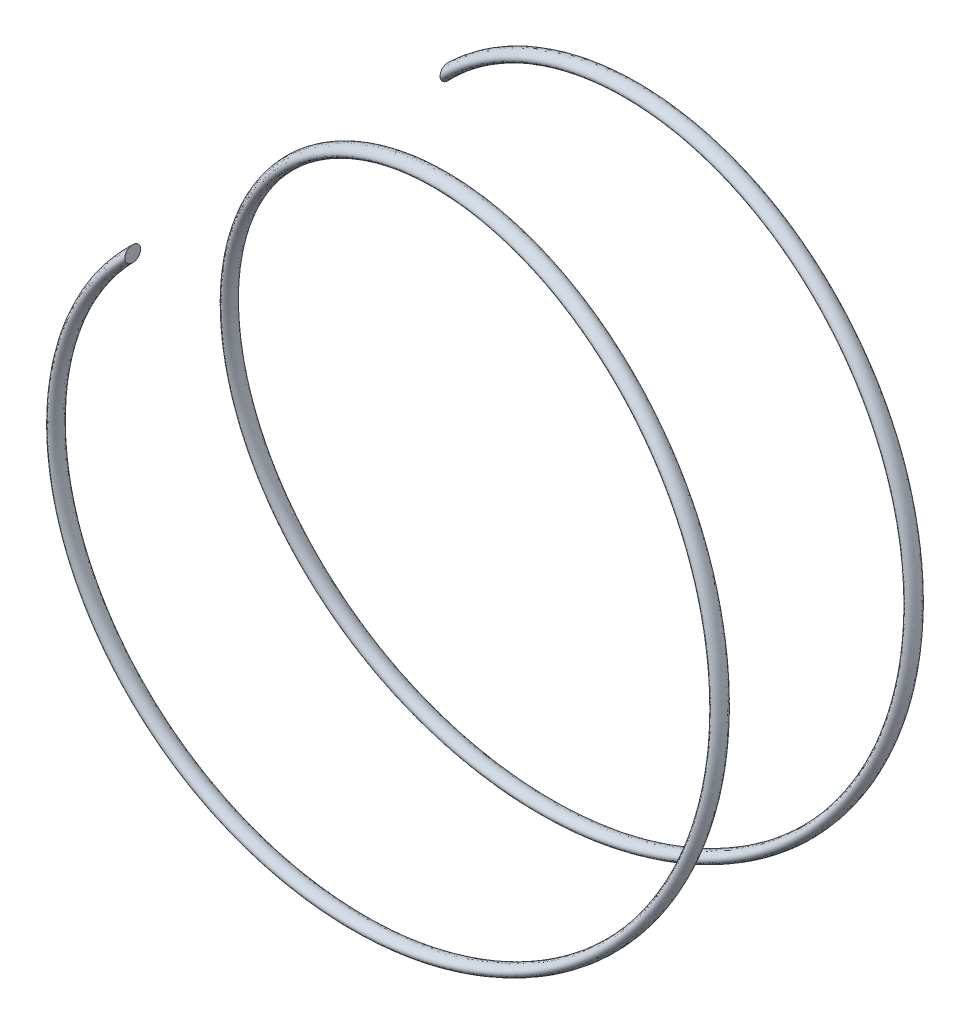
ISO-10303-21;
HEADER;
FILE_DESCRIPTION(('STEP AP214'),'2;1');
FILE_NAME('part.step','',(''),(''),'','','');
FILE_SCHEMA(('AUTOMOTIVE_DESIGN { 1 0 10303 214 1 1 1 1 }'));
ENDSEC;
DATA;
#1=APPLICATION_CONTEXT('core data for automotive mechanical design processes');
#2=APPLICATION_PROTOCOL_DEFINITION('international standard','automotive_design',2000,#1);
#3=PRODUCT_CONTEXT('',#1,'mechanical');
#4=PRODUCT('Part','Part','',(#3));
#5=PRODUCT_RELATED_PRODUCT_CATEGORY('part','',(#4));
#6=PRODUCT_DEFINITION_FORMATION('','',#4);
#7=PRODUCT_DEFINITION_CONTEXT('part definition',#1,'design');
#8=PRODUCT_DEFINITION('design','',#6,#7);
#9=PRODUCT_DEFINITION_SHAPE('','',#8);
#10=(LENGTH_UNIT() NAMED_UNIT(*) SI_UNIT(.MILLI.,.METRE.));
#11=(NAMED_UNIT(*) PLANE_ANGLE_UNIT() SI_UNIT($,.RADIAN.));
#12=(NAMED_UNIT(*) SI_UNIT($,.STERADIAN.) SOLID_ANGLE_UNIT());
#13=UNCERTAINTY_MEASURE_WITH_UNIT(LENGTH_MEASURE(1.E-05),#10,'distance_accuracy_value','');
#14=(GEOMETRIC_REPRESENTATION_CONTEXT(3) GLOBAL_UNCERTAINTY_ASSIGNED_CONTEXT((#13)) GLOBAL_UNIT_ASSIGNED_CONTEXT((#10,
#11,#12)) REPRESENTATION_CONTEXT('',''));
#15=CARTESIAN_POINT('',(0.,0.,0.));
#16=DIRECTION('',(0.,0.,1.));
#17=DIRECTION('',(1.,0.,0.));
#18=AXIS2_PLACEMENT_3D('',#15,#16,#17);
#19=CARTESIAN_POINT('',(-2.65165042944957,2.66597995861753,0.101046306250281));
#20=DIRECTION('',(1.,0.,0.));
#21=DIRECTION('',(0.,0.,-1.));
#22=AXIS2_PLACEMENT_3D('',#19,#20,#21);
#23=PLANE('',#22);
#24=CARTESIAN_POINT('',(-2.65165042944957,2.66597995861753,0.101046306250281));
#25=DIRECTION('',(1.,0.,0.));
#26=DIRECTION('',(0.,0.,-1.));
#27=AXIS2_PLACEMENT_3D('',#24,#25,#26);
#28=CIRCLE('',#27,0.0999999999999999);
#29=CARTESIAN_POINT('',(-2.65165042944957,2.66597995861753,0.00104630625028135));
#30=VERTEX_POINT('',#29);
#31=EDGE_CURVE('E38',#30,#30,#28,.T.);
#32=ORIENTED_EDGE('',*,*,#31,.F.);
#33=EDGE_LOOP('',(#32));
#34=FACE_BOUND('',#33,.T.);
#35=ADVANCED_FACE('F34',(#34),#23,.F.);
#36=CARTESIAN_POINT('',(-2.6516504294495,2.6659799586176,4.10104630625028));
#37=DIRECTION('',(1.,0.,0.));
#38=DIRECTION('',(0.,0.,-1.));
#39=AXIS2_PLACEMENT_3D('',#36,#37,#38);
#40=PLANE('',#39);
#41=CARTESIAN_POINT('',(-2.6516504294495,2.6659799586176,4.10104630625028));
#42=DIRECTION('',(1.,0.,0.));
#43=DIRECTION('',(0.,0.,-1.));
#44=AXIS2_PLACEMENT_3D('',#41,#42,#43);
#45=CIRCLE('',#44,0.0999999999999999);
#46=CARTESIAN_POINT('',(-2.6516504294495,2.6659799586176,4.00104630625028));
#47=VERTEX_POINT('',#46);
#48=EDGE_CURVE('E11',#47,#47,#45,.T.);
#49=ORIENTED_EDGE('',*,*,#48,.T.);
#50=EDGE_LOOP('',(#49));
#51=FACE_BOUND('',#50,.T.);
#52=ADVANCED_FACE('F53',(#51),#40,.T.);
#53=CARTESIAN_POINT('',(-2.65165042944957,2.66597995861753,0.00104630625028135));
#54=CARTESIAN_POINT('',(-1.94950034318213,3.36435598488586,0.0429635952522216));
#55=CARTESIAN_POINT('',(-1.0893230480405,3.68756131874415,0.0843796395836056));
#56=CARTESIAN_POINT('',(0.513482321036223,3.81065206953208,0.167712972916957));
#57=CARTESIAN_POINT('',(1.25917011962506,3.61077765600955,0.209379639583639));
#58=CARTESIAN_POINT('',(2.46828736551713,2.92075028586278,0.292712972916924));
#59=CARTESIAN_POINT('',(2.93490058438952,2.43159991045056,0.334379639583593));
#60=CARTESIAN_POINT('',(3.5620154117044,1.35586350174244,0.417712972916969));
#61=CARTESIAN_POINT('',(3.724224759724,0.769328343117185,0.45937963958359));
#62=CARTESIAN_POINT('',(3.81573165165694,-0.93325202629299,0.584379639583664));
#63=CARTESIAN_POINT('',(3.34960233951057,-1.97177950299939,0.667712972916829));
#64=CARTESIAN_POINT('',(1.95369851938853,-3.36018041423571,0.834379639583734));
#65=CARTESIAN_POINT('',(1.03413596535603,-3.72082018190569,0.917712972917011));
#66=CARTESIAN_POINT('',(-0.725334134401599,-3.79312937795967,1.08437963958355));
#67=CARTESIAN_POINT('',(-1.56373675281514,-3.5127568340436,1.16771297291694));
#68=CARTESIAN_POINT('',(-2.86321944399203,-2.56645819674386,1.33437963958362));
#69=CARTESIAN_POINT('',(-3.32605282941432,-1.90520739082926,1.417712972917));
#70=CARTESIAN_POINT('',(-3.8010084843856,-0.494749606355944,1.58437963958356));
#71=CARTESIAN_POINT('',(-3.81569850147125,0.252328429213811,1.66771297291693));
#72=CARTESIAN_POINT('',(-3.47251329273059,1.60152307558878,1.83437963958363));
#73=CARTESIAN_POINT('',(-3.11695809296724,2.2031733040498,1.91771297291682));
#74=CARTESIAN_POINT('',(-2.18634276593182,3.12878661318533,2.08437963958374));
#75=CARTESIAN_POINT('',(-1.58278504513302,3.48109411403026,2.16771297291701));
#76=CARTESIAN_POINT('',(-0.231760429822169,3.81700298578428,2.33437963958355));
#77=CARTESIAN_POINT('',(0.515227585571434,3.79828687784704,2.41771297291684));
#78=CARTESIAN_POINT('',(1.92310515888396,3.31573659599097,2.58437963958373));
#79=CARTESIAN_POINT('',(2.58185196612051,2.84934618555282,2.66771297291712));
#80=CARTESIAN_POINT('',(3.52113342518604,1.5447823824912,2.83437963958344));
#81=CARTESIAN_POINT('',(3.79698340814531,0.704880899604193,2.91771297291721));
#82=CARTESIAN_POINT('',(3.71519276977669,-1.05417394399935,3.08437963958336));
#83=CARTESIAN_POINT('',(3.34960234697262,-1.97177951050093,3.16771297291699));
#84=CARTESIAN_POINT('',(1.95369851192641,-3.36018040673424,3.33437963958357));
#85=CARTESIAN_POINT('',(0.912673959223943,-3.82070590678891,3.41771297291677));
#86=CARTESIAN_POINT('',(-0.789388516243727,-3.72002445299543,3.54271297291704));
#87=CARTESIAN_POINT('',(-1.37504094520363,-3.5546563867117,3.58437963958368));
#88=CARTESIAN_POINT('',(-2.44738195687672,-2.92175309051048,3.66771297291688));
#89=CARTESIAN_POINT('',(-2.93401046196466,-2.45251042000341,3.70937963958369));
#90=CARTESIAN_POINT('',(-3.61751139144706,-1.23969189883968,3.79271297291687));
#91=CARTESIAN_POINT('',(-3.81336409055868,-0.492937726181052,3.83437963958403));
#92=CARTESIAN_POINT('',(-3.68163696422959,1.10918097987589,3.91771297291653));
#93=CARTESIAN_POINT('',(-3.35380048553992,1.96760390200431,3.95912901725066));
#94=CARTESIAN_POINT('',(-2.6516504294495,2.6659799586176,4.00104630625028));
#95=CARTESIAN_POINT('',(-2.65165042944957,2.71833983617736,0.00104630625028135));
#96=CARTESIAN_POINT('',(-1.93570995938385,3.41671600959796,0.04296360410236));
#97=CARTESIAN_POINT('',(-1.06386651022793,3.73466535616011,0.0843796395836056));
#98=CARTESIAN_POINT('',(0.55597197809443,3.84323204378034,0.167712972916957));
#99=CARTESIAN_POINT('',(1.30705916057458,3.6340617320072,0.209379639583639));
#100=CARTESIAN_POINT('',(2.52133796176687,2.92534840408302,0.292712972916924));
#101=CARTESIAN_POINT('',(2.98775463041151,2.42678660335673,0.334379639583593));
#102=CARTESIAN_POINT('',(3.61049733399309,1.33427134275712,0.417712972916969));
#103=CARTESIAN_POINT('',(3.76854846848225,0.740352490067321,0.45937963958359));
#104=CARTESIAN_POINT('',(3.84423969516893,-0.979935920989196,0.584379639583664));
#105=CARTESIAN_POINT('',(3.36331012325847,-2.0241393804856,0.667712972916829));
#106=CARTESIAN_POINT('',(1.93999073564064,-3.41254029186915,0.834379639583734));
#107=CARTESIAN_POINT('',(1.00780797186221,-3.7677106521392,0.917712972917011));
#108=CARTESIAN_POINT('',(-0.769743319108554,-3.82345599607138,1.08437963958355));
#109=CARTESIAN_POINT('',(-1.613670207691,-3.53208235466336,1.16771297291694));
#110=CARTESIAN_POINT('',(-2.91669007707334,-2.56368023503987,1.33437963958362));
#111=CARTESIAN_POINT('',(-3.377599591548,-1.89135598578812,1.417712972917));
#112=CARTESIAN_POINT('',(-3.84339394782677,-0.462308851036206,1.58437963958356));
#113=CARTESIAN_POINT('',(-3.85089279428778,0.29228928749988,1.66771297291693));
#114=CARTESIAN_POINT('',(-3.49107043517011,1.65143440610568,1.83437963958363));
#115=CARTESIAN_POINT('',(-3.12609674091945,2.25553318160963,1.91771297291682));
#116=CARTESIAN_POINT('',(-2.17720411797961,3.18114649074516,2.08437963958374));
#117=CARTESIAN_POINT('',(-1.56422790269358,3.53100544454708,2.16771297291701));
#118=CARTESIAN_POINT('',(-0.19656613700556,3.85696384407042,2.33437963958355));
#119=CARTESIAN_POINT('',(0.557613049012694,3.83072763316663,2.41771297291684));
#120=CARTESIAN_POINT('',(1.97465192101755,3.32958800103226,2.58437963958373));
#121=CARTESIAN_POINT('',(2.63532259920172,2.85212414725678,2.66771297291712));
#122=CARTESIAN_POINT('',(3.57106688006198,1.52545686187146,2.83437963958344));
#123=CARTESIAN_POINT('',(3.84139259285163,0.674554281491703,2.91771297291721));
#124=CARTESIAN_POINT('',(3.74152076327114,-1.10106441423209,3.08437963958336));
#125=CARTESIAN_POINT('',(3.36331013072053,-2.02413938813437,3.16771297291699));
#126=CARTESIAN_POINT('',(1.93999072817849,-3.41254028422046,3.33437963958357));
#127=CARTESIAN_POINT('',(0.884165915711982,-3.86738980148496,3.41771297291677));
#128=CARTESIAN_POINT('',(-0.83371222500199,-3.74900030604537,3.54271297291704));
#129=CARTESIAN_POINT('',(-1.42352286749225,-3.57624854569706,3.58437963958368));
#130=CARTESIAN_POINT('',(-2.50023600289879,-2.92656639760427,3.66771297291688));
#131=CARTESIAN_POINT('',(-2.98706105821439,-2.4479123017832,3.70937963958369));
#132=CARTESIAN_POINT('',(-3.66540043239658,-1.21640782284201,3.79271297291687));
#133=CARTESIAN_POINT('',(-3.85585374761686,-0.460357751932772,3.83437963958403));
#134=CARTESIAN_POINT('',(-3.70709350204217,1.15628501729184,3.91771297291653));
#135=CARTESIAN_POINT('',(-3.36759086933787,2.01996363181558,3.95912900840053));
#136=CARTESIAN_POINT('',(-2.65165042944949,2.71833983617743,4.00104630625028));
#137=CARTESIAN_POINT('',(-2.65165042944957,2.76597995861753,0.0486864286904514));
#138=CARTESIAN_POINT('',(-1.92316264651363,3.46435626206985,0.0906037343634182));
#139=CARTESIAN_POINT('',(-1.04070464211788,3.77752340347603,0.132019762023776));
#140=CARTESIAN_POINT('',(0.594631588449235,3.87287523690124,0.215353095357127));
#141=CARTESIAN_POINT('',(1.3506314506698,3.65524696549372,0.25701976202379));
#142=CARTESIAN_POINT('',(2.56960654104236,2.9295320447869,0.340353095357113));
#143=CARTESIAN_POINT('',(3.03584437663138,2.42240717105136,0.382019762023781));
#144=CARTESIAN_POINT('',(3.65460906269833,1.31462551572794,0.465353095357122));
#145=CARTESIAN_POINT('',(3.80887680786453,0.71398854019898,0.50701976202376));
#146=CARTESIAN_POINT('',(3.87017800417059,-1.02241169753734,0.632019762023834));
#147=CARTESIAN_POINT('',(3.37578227801817,-2.07177950285871,0.715353095356999));
#148=CARTESIAN_POINT('',(1.92751858088093,-3.46018041437639,0.882019762023904));
#149=CARTESIAN_POINT('',(0.983853201681232,-3.81037438336413,0.965353095357181));
#150=CARTESIAN_POINT('',(-0.810149429579107,-3.8510489521169,1.13201976202372));
#151=CARTESIAN_POINT('',(-1.65910262684515,-3.54966585965689,1.21535309535711));
#152=CARTESIAN_POINT('',(-2.96534083077351,-2.56115268070115,1.38201976202379));
#153=CARTESIAN_POINT('',(-3.42449989334149,-1.87875315585636,1.46535309535717));
#154=CARTESIAN_POINT('',(-3.88195875664875,-0.432792327554795,1.63201976202373));
#155=CARTESIAN_POINT('',(-3.88291464951578,0.328648046730817,1.7153530953571));
#156=CARTESIAN_POINT('',(-3.50795482411747,1.69684669520554,1.8820197620238));
#157=CARTESIAN_POINT('',(-3.13441162490442,2.3031733040498,1.96535309535699));
#158=CARTESIAN_POINT('',(-2.16888923399465,3.22878661318533,2.13201976202391));
#159=CARTESIAN_POINT('',(-1.54734351374614,3.57641773364709,2.21535309535718));
#160=CARTESIAN_POINT('',(-0.164544281777633,3.8933226033012,2.38201976202372));
#161=CARTESIAN_POINT('',(0.596177857834515,3.86024415664827,2.46535309535701));
#162=CARTESIAN_POINT('',(2.0215522228112,3.34219083096378,2.6320197620239));
#163=CARTESIAN_POINT('',(2.68397335290207,2.85465170159566,2.71535309535729));
#164=CARTESIAN_POINT('',(3.61649929921596,1.50787335687776,2.88201976202361));
#165=CARTESIAN_POINT('',(3.8817987033215,0.646961325445991,2.96535309535738));
#166=CARTESIAN_POINT('',(3.7654755334528,-1.14372814545682,3.13201976202353));
#167=CARTESIAN_POINT('',(3.37578228548047,-2.0717795106416,3.21535309535716));
#168=CARTESIAN_POINT('',(1.92751857341856,-3.46018040659356,3.38201976202374));
#169=CARTESIAN_POINT('',(0.8582276067101,-3.90986557803288,3.46535309535694));
#170=CARTESIAN_POINT('',(-0.874040564384169,-3.77536425591382,3.59035309535721));
#171=CARTESIAN_POINT('',(-1.46763459619748,-3.59589437272631,3.63201976202385));
#172=CARTESIAN_POINT('',(-2.54832574911866,-2.93094582990956,3.71535309535705));
#173=CARTESIAN_POINT('',(-3.03532963749012,-2.4437286610793,3.75701976202386));
#174=CARTESIAN_POINT('',(-3.70897272249158,-1.1952225893555,3.84035309535704));
#175=CARTESIAN_POINT('',(-3.89451335797183,-0.430714558812035,3.8820197620242));
#176=CARTESIAN_POINT('',(-3.73025537015206,1.19914306460792,3.9653530953567));
#177=CARTESIAN_POINT('',(-3.38013818220886,2.06760362368254,4.0067691230198));
#178=CARTESIAN_POINT('',(-2.65165042944949,2.7659799586176,4.04868642869045));
#179=CARTESIAN_POINT('',(-2.65165042944957,2.76597995861753,0.153406183810111));
#180=CARTESIAN_POINT('',(-1.92316264651363,3.46435626206985,0.195323489483061));
#181=CARTESIAN_POINT('',(-1.04070464211788,3.77752340347603,0.236739517143413));
#182=CARTESIAN_POINT('',(0.594631588449235,3.87287523690124,0.320072850476809));
#183=CARTESIAN_POINT('',(1.3506314506698,3.65524696549372,0.361739517143449));
#184=CARTESIAN_POINT('',(2.56960654104236,2.9295320447869,0.445072850476773));
#185=CARTESIAN_POINT('',(3.03584437663138,2.42240717105136,0.48673951714344));
#186=CARTESIAN_POINT('',(3.65460906269833,1.31462551572794,0.570072850476782));
#187=CARTESIAN_POINT('',(3.80887680786453,0.71398854019898,0.61173951714342));
#188=CARTESIAN_POINT('',(3.87017800417059,-1.02241169753734,0.736739517143494));
#189=CARTESIAN_POINT('',(3.37578227801817,-2.07177950285871,0.820072850476713));
#190=CARTESIAN_POINT('',(1.92751858088093,-3.46018041437639,0.986739517143509));
#191=CARTESIAN_POINT('',(0.983853201681232,-3.81037438336413,1.07007285047684));
#192=CARTESIAN_POINT('',(-0.810149429579107,-3.8510489521169,1.23673951714338));
#193=CARTESIAN_POINT('',(-1.65910262684515,-3.54966585965689,1.32007285047677));
#194=CARTESIAN_POINT('',(-2.96534083077351,-2.56115268070115,1.48673951714345));
#195=CARTESIAN_POINT('',(-3.42449989334149,-1.87875315585636,1.57007285047683));
#196=CARTESIAN_POINT('',(-3.88195875664875,-0.432792327554795,1.73673951714339));
#197=CARTESIAN_POINT('',(-3.88291464951578,0.328648046730817,1.82007285047676));
#198=CARTESIAN_POINT('',(-3.50795482411747,1.69684669520554,1.98673951714346));
#199=CARTESIAN_POINT('',(-3.13441162490442,2.3031733040498,2.07007285047665));
#200=CARTESIAN_POINT('',(-2.16888923399465,3.22878661318533,2.23673951714357));
#201=CARTESIAN_POINT('',(-1.54734351374614,3.57641773364709,2.32007285047684));
#202=CARTESIAN_POINT('',(-0.164544281777633,3.8933226033012,2.48673951714338));
#203=CARTESIAN_POINT('',(0.596177857834515,3.86024415664827,2.57007285047667));
#204=CARTESIAN_POINT('',(2.0215522228112,3.34219083096378,2.73673951714356));
#205=CARTESIAN_POINT('',(2.68397335290207,2.85465170159566,2.82007285047695));
#206=CARTESIAN_POINT('',(3.61649929921596,1.50787335687776,2.98673951714327));
#207=CARTESIAN_POINT('',(3.8817987033215,0.646961325445991,3.07007285047704));
#208=CARTESIAN_POINT('',(3.7654755334528,-1.14372814545682,3.23673951714319));
#209=CARTESIAN_POINT('',(3.37578228548047,-2.0717795106416,3.32007285047682));
#210=CARTESIAN_POINT('',(1.92751857341856,-3.46018040659356,3.4867395171434));
#211=CARTESIAN_POINT('',(0.8582276067101,-3.90986557803288,3.5700728504766));
#212=CARTESIAN_POINT('',(-0.874040564384169,-3.77536425591382,3.69507285047687));
#213=CARTESIAN_POINT('',(-1.46763459619748,-3.59589437272631,3.73673951714351));
#214=CARTESIAN_POINT('',(-2.54832574911866,-2.93094582990956,3.82007285047671));
#215=CARTESIAN_POINT('',(-3.03532963749012,-2.4437286610793,3.86173951714352));
#216=CARTESIAN_POINT('',(-3.70897272249158,-1.1952225893555,3.9450728504767));
#217=CARTESIAN_POINT('',(-3.89451335797183,-0.430714558812035,3.98673951714386));
#218=CARTESIAN_POINT('',(-3.73025537015206,1.19914306460792,4.07007285047636));
#219=CARTESIAN_POINT('',(-3.38013818220886,2.06760362368254,4.11148887813946));
#220=CARTESIAN_POINT('',(-2.65165042944949,2.7659799586176,4.15340618381011));
#221=CARTESIAN_POINT('',(-2.65165042944957,2.71833983617736,0.201046306250281));
#222=CARTESIAN_POINT('',(-1.93570995938385,3.41671600959796,0.242963604102338));
#223=CARTESIAN_POINT('',(-1.06386651022793,3.73466535616011,0.284379639583605));
#224=CARTESIAN_POINT('',(0.55597197809443,3.84323204378034,0.367712972916957));
#225=CARTESIAN_POINT('',(1.30705916057458,3.6340617320072,0.409379639583639));
#226=CARTESIAN_POINT('',(2.52133796176687,2.92534840408302,0.492712972916924));
#227=CARTESIAN_POINT('',(2.98775463041151,2.42678660335673,0.53437963958361));
#228=CARTESIAN_POINT('',(3.61049733399309,1.33427134275712,0.617712972916952));
#229=CARTESIAN_POINT('',(3.76854846848225,0.740352490067321,0.65937963958359));
#230=CARTESIAN_POINT('',(3.84423969516893,-0.979935920989196,0.784379639583664));
#231=CARTESIAN_POINT('',(3.36331012325847,-2.0241393804856,0.867712972916829));
#232=CARTESIAN_POINT('',(1.93999073564064,-3.41254029186915,1.03437963958373));
#233=CARTESIAN_POINT('',(1.00780797186221,-3.7677106521392,1.11771297291701));
#234=CARTESIAN_POINT('',(-0.769743319108554,-3.82345599607138,1.28437963958355));
#235=CARTESIAN_POINT('',(-1.613670207691,-3.53208235466336,1.36771297291694));
#236=CARTESIAN_POINT('',(-2.91669007707334,-2.56368023503987,1.53437963958362));
#237=CARTESIAN_POINT('',(-3.377599591548,-1.89135598578812,1.617712972917));
#238=CARTESIAN_POINT('',(-3.84339394782677,-0.462308851036206,1.78437963958356));
#239=CARTESIAN_POINT('',(-3.85089279428778,0.29228928749988,1.86771297291701));
#240=CARTESIAN_POINT('',(-3.49107043517011,1.65143440610568,2.03437963958355));
#241=CARTESIAN_POINT('',(-3.12609674091945,2.25553318160963,2.11771297291682));
#242=CARTESIAN_POINT('',(-2.17720411797961,3.18114649074516,2.28437963958374));
#243=CARTESIAN_POINT('',(-1.56422790269358,3.53100544454708,2.36771297291701));
#244=CARTESIAN_POINT('',(-0.19656613700556,3.85696384407042,2.53437963958355));
#245=CARTESIAN_POINT('',(0.557613049012694,3.83072763316663,2.61771297291684));
#246=CARTESIAN_POINT('',(1.97465192101755,3.32958800103226,2.78437963958373));
#247=CARTESIAN_POINT('',(2.63532259920172,2.85212414725678,2.86771297291712));
#248=CARTESIAN_POINT('',(3.57106688006198,1.52545686187146,3.03437963958344));
#249=CARTESIAN_POINT('',(3.84139259285163,0.674554281491703,3.11771297291721));
#250=CARTESIAN_POINT('',(3.74152076327114,-1.10106441423209,3.28437963958336));
#251=CARTESIAN_POINT('',(3.36331013072053,-2.02413938813437,3.36771297291699));
#252=CARTESIAN_POINT('',(1.93999072817849,-3.41254028422046,3.53437963958357));
#253=CARTESIAN_POINT('',(0.884165915711982,-3.86738980148496,3.61771297291677));
#254=CARTESIAN_POINT('',(-0.83371222500199,-3.74900030604537,3.74271297291704));
#255=CARTESIAN_POINT('',(-1.42352286749225,-3.57624854569706,3.78437963958368));
#256=CARTESIAN_POINT('',(-2.50023600289879,-2.92656639760427,3.86771297291688));
#257=CARTESIAN_POINT('',(-2.98706105821439,-2.4479123017832,3.90937963958369));
#258=CARTESIAN_POINT('',(-3.66540043239658,-1.21640782284201,3.99271297291687));
#259=CARTESIAN_POINT('',(-3.85585374761686,-0.460357751932772,4.03437963958403));
#260=CARTESIAN_POINT('',(-3.70709350204217,1.15628501729184,4.11771297291653));
#261=CARTESIAN_POINT('',(-3.36759086933787,2.01996363181558,4.15912900840053));
#262=CARTESIAN_POINT('',(-2.65165042944949,2.71833983617743,4.20104630625028));
#263=CARTESIAN_POINT('',(-2.65165042944957,2.6136200810577,0.201046306250281));
#264=CARTESIAN_POINT('',(-1.96329072698041,3.31199596017376,0.242963586402061));
#265=CARTESIAN_POINT('',(-1.11477958585306,3.64045728132818,0.284379639583605));
#266=CARTESIAN_POINT('',(0.470992663978016,3.77807209528382,0.367712972916957));
#267=CARTESIAN_POINT('',(1.21128107867554,3.58749358001191,0.409379639583639));
#268=CARTESIAN_POINT('',(2.41523676926739,2.91615216764255,0.492712972916924));
#269=CARTESIAN_POINT('',(2.88204653836752,2.43641321754439,0.53437963958361));
#270=CARTESIAN_POINT('',(3.51353348941571,1.37745566072775,0.617712972916952));
#271=CARTESIAN_POINT('',(3.67990105096575,0.79830419616705,0.65937963958359));
#272=CARTESIAN_POINT('',(3.78722360814494,-0.886568131596783,0.784379639583664));
#273=CARTESIAN_POINT('',(3.33589455576267,-1.91941962551317,0.867712972916829));
#274=CARTESIAN_POINT('',(1.96740630313643,-3.30782053660226,1.03437963958373));
#275=CARTESIAN_POINT('',(1.06046395884985,-3.67392971167217,1.11771297291701));
#276=CARTESIAN_POINT('',(-0.680924949694644,-3.76280275984797,1.28437963958355));
#277=CARTESIAN_POINT('',(-1.51380329793929,-3.49343131342384,1.36771297291694));
#278=CARTESIAN_POINT('',(-2.80974881091073,-2.56923615844786,1.53437963958362));
#279=CARTESIAN_POINT('',(-3.27450606728064,-1.91905879587041,1.617712972917));
#280=CARTESIAN_POINT('',(-3.75862302094443,-0.527190361675682,1.78437963958356));
#281=CARTESIAN_POINT('',(-3.78050420865472,0.212367570927743,1.86771297291701));
#282=CARTESIAN_POINT('',(-3.45395615029107,1.55161174507188,2.03437963958355));
#283=CARTESIAN_POINT('',(-3.10781944501504,2.15081342648997,2.11771297291682));
#284=CARTESIAN_POINT('',(-2.19548141388403,3.0764267356255,2.28437963958374));
#285=CARTESIAN_POINT('',(-1.60134218757246,3.43118278351343,2.36771297291701));
#286=CARTESIAN_POINT('',(-0.266954722638779,3.77704212749813,2.53437963958355));
#287=CARTESIAN_POINT('',(0.472842122130173,3.76584612252745,2.61771297291684));
#288=CARTESIAN_POINT('',(1.87155839675038,3.30188519094969,2.78437963958373));
#289=CARTESIAN_POINT('',(2.5283813330393,2.84656822384885,2.86771297291712));
#290=CARTESIAN_POINT('',(3.47119997031009,1.56410790311093,3.03437963958344));
#291=CARTESIAN_POINT('',(3.75257422343899,0.735207517716684,3.11771297291721));
#292=CARTESIAN_POINT('',(3.68886477628223,-1.00728347376662,3.28437963958336));
#293=CARTESIAN_POINT('',(3.3358945632247,-1.91941963286748,3.36771297291699));
#294=CARTESIAN_POINT('',(1.96740629567433,-3.30782052924803,3.53437963958357));
#295=CARTESIAN_POINT('',(0.941182002735905,-3.77402201209286,3.61771297291677));
#296=CARTESIAN_POINT('',(-0.745064807485463,-3.69104859994549,3.74271297291704));
#297=CARTESIAN_POINT('',(-1.32655902291501,-3.53306422772634,3.78437963958368));
#298=CARTESIAN_POINT('',(-2.39452791085465,-2.9169397834167,3.86771297291688));
#299=CARTESIAN_POINT('',(-2.88095986571492,-2.45710853822362,3.90937963958369));
#300=CARTESIAN_POINT('',(-3.56962235049754,-1.26297597483735,3.99271297291687));
#301=CARTESIAN_POINT('',(-3.77087443350049,-0.525517700429332,4.03437963958403));
#302=CARTESIAN_POINT('',(-3.65618042641701,1.06207694245994,4.11771297291653));
#303=CARTESIAN_POINT('',(-3.34001010174196,1.91524417219305,4.15912902610079));
#304=CARTESIAN_POINT('',(-2.6516504294495,2.61362008105777,4.20104630625028));
#305=CARTESIAN_POINT('',(-2.65165042944957,2.56597995861753,0.153406183810111));
#306=CARTESIAN_POINT('',(-1.97583803219092,3.26435569998692,0.195323455677938));
#307=CARTESIAN_POINT('',(-1.13794145396302,3.59759923401226,0.236739517143435));
#308=CARTESIAN_POINT('',(0.432333053623123,3.74842890216292,0.320072850476787));
#309=CARTESIAN_POINT('',(1.1677087885804,3.56630834652524,0.361739517143469));
#310=CARTESIAN_POINT('',(2.36696818999181,2.91196852693882,0.445072850476754));
#311=CARTESIAN_POINT('',(2.83395679214793,2.44079264984976,0.48673951714344));
#312=CARTESIAN_POINT('',(3.4694217607102,1.39710148775694,0.570072850476782));
#313=CARTESIAN_POINT('',(3.63957271158359,0.824668146035454,0.61173951714342));
#314=CARTESIAN_POINT('',(3.76128529914303,-0.844092355048768,0.736739517143494));
#315=CARTESIAN_POINT('',(3.32342240100297,-1.87177950314006,0.820072850476659));
#316=CARTESIAN_POINT('',(1.97987845789613,-3.26018041409503,0.986739517143564));
#317=CARTESIAN_POINT('',(1.08441872903083,-3.63126598044725,1.07007285047684));
#318=CARTESIAN_POINT('',(-0.640518839224091,-3.73520980380245,1.23673951714338));
#319=CARTESIAN_POINT('',(-1.46837087878514,-3.47584780842994,1.32007285047686));
#320=CARTESIAN_POINT('',(-2.76109805721056,-2.57176371278693,1.48673951714336));
#321=CARTESIAN_POINT('',(-3.22760576548682,-1.93166162580207,1.57007285047683));
#322=CARTESIAN_POINT('',(-3.72005821212278,-0.556706885157176,1.73673951714339));
#323=CARTESIAN_POINT('',(-3.74848235342656,0.176008811696651,1.82007285047668));
#324=CARTESIAN_POINT('',(-3.43707176134387,1.50619945597217,1.98673951714354));
#325=CARTESIAN_POINT('',(-3.09950456102992,2.1031733040498,2.07007285047665));
#326=CARTESIAN_POINT('',(-2.20379629786914,3.02878661318533,2.23673951714357));
#327=CARTESIAN_POINT('',(-1.61822657651974,3.38577049441342,2.32007285047684));
#328=CARTESIAN_POINT('',(-0.29897657786686,3.74068336826735,2.48673951714338));
#329=CARTESIAN_POINT('',(0.434277313308351,3.7363295990458,2.57007285047667));
#330=CARTESIAN_POINT('',(1.82465809495673,3.28928236101817,2.73673951714356));
#331=CARTESIAN_POINT('',(2.47973057933913,2.84404066950998,2.82007285047695));
#332=CARTESIAN_POINT('',(3.42576755115594,1.58169140810463,2.98673951714327));
#333=CARTESIAN_POINT('',(3.71216811296893,0.762800473762494,3.07007285047704));
#334=CARTESIAN_POINT('',(3.66491000610077,-0.964619742541988,3.23673951714319));
#335=CARTESIAN_POINT('',(3.32342240846499,-1.87177951036025,3.32007285047682));
#336=CARTESIAN_POINT('',(1.97987845043405,-3.26018040687492,3.4867395171434));
#337=CARTESIAN_POINT('',(0.967120311737659,-3.73154623554468,3.5700728504766));
#338=CARTESIAN_POINT('',(-0.704736468103221,-3.66468465007716,3.69507285047687));
#339=CARTESIAN_POINT('',(-1.28244729420963,-3.51341840069722,3.73673951714351));
#340=CARTESIAN_POINT('',(-2.34643816463492,-2.91256035111127,3.82007285047671));
#341=CARTESIAN_POINT('',(-2.83269128643935,-2.46129217892745,3.86173951714352));
#342=CARTESIAN_POINT('',(-3.52605006040239,-1.28416120832393,3.9450728504767));
#343=CARTESIAN_POINT('',(-3.73221482314553,-0.555160893550068,3.98673951714386));
#344=CARTESIAN_POINT('',(-3.63301855830712,1.01921889514386,4.07007285047636));
#345=CARTESIAN_POINT('',(-3.32746279653114,1.86760418804145,4.1114889119446));
#346=CARTESIAN_POINT('',(-2.6516504294495,2.5659799586176,4.15340618381011));
#347=CARTESIAN_POINT('',(-2.65165042944957,2.56597995861753,0.0486864286904514));
#348=CARTESIAN_POINT('',(-1.97583803219092,3.26435569998692,0.0906037005582951));
#349=CARTESIAN_POINT('',(-1.13794145396302,3.59759923401226,0.132019762023776));
#350=CARTESIAN_POINT('',(0.432333053623123,3.74842890216292,0.215353095357127));
#351=CARTESIAN_POINT('',(1.1677087885804,3.56630834652524,0.257019762023809));
#352=CARTESIAN_POINT('',(2.36696818999181,2.91196852693882,0.340353095357094));
#353=CARTESIAN_POINT('',(2.83395679214793,2.44079264984976,0.382019762023763));
#354=CARTESIAN_POINT('',(3.4694217607102,1.39710148775694,0.46535309535714));
#355=CARTESIAN_POINT('',(3.63957271158359,0.824668146035454,0.50701976202376));
#356=CARTESIAN_POINT('',(3.76128529914303,-0.844092355048768,0.632019762023834));
#357=CARTESIAN_POINT('',(3.32342240100297,-1.87177950314006,0.715353095356999));
#358=CARTESIAN_POINT('',(1.97987845789613,-3.26018041409503,0.882019762023904));
#359=CARTESIAN_POINT('',(1.08441872903083,-3.63126598044725,0.965353095357181));
#360=CARTESIAN_POINT('',(-0.640518839224091,-3.73520980380245,1.13201976202372));
#361=CARTESIAN_POINT('',(-1.46837087878514,-3.47584780842994,1.21535309535711));
#362=CARTESIAN_POINT('',(-2.76109805721056,-2.57176371278693,1.38201976202379));
#363=CARTESIAN_POINT('',(-3.22760576548682,-1.93166162580207,1.46535309535717));
#364=CARTESIAN_POINT('',(-3.72005821212278,-0.556706885157176,1.63201976202373));
#365=CARTESIAN_POINT('',(-3.74848235342656,0.176008811696651,1.7153530953571));
#366=CARTESIAN_POINT('',(-3.43707176134387,1.50619945597217,1.8820197620238));
#367=CARTESIAN_POINT('',(-3.09950456102992,2.1031733040498,1.96535309535699));
#368=CARTESIAN_POINT('',(-2.20379629786914,3.02878661318533,2.13201976202391));
#369=CARTESIAN_POINT('',(-1.61822657651974,3.38577049441342,2.21535309535718));
#370=CARTESIAN_POINT('',(-0.29897657786686,3.74068336826735,2.38201976202372));
#371=CARTESIAN_POINT('',(0.434277313308351,3.7363295990458,2.46535309535701));
#372=CARTESIAN_POINT('',(1.82465809495673,3.28928236101817,2.6320197620239));
#373=CARTESIAN_POINT('',(2.47973057933913,2.84404066950998,2.71535309535729));
#374=CARTESIAN_POINT('',(3.42576755115594,1.58169140810463,2.88201976202361));
#375=CARTESIAN_POINT('',(3.71216811296893,0.762800473762494,2.96535309535738));
#376=CARTESIAN_POINT('',(3.66491000610077,-0.964619742541988,3.13201976202353));
#377=CARTESIAN_POINT('',(3.32342240846499,-1.87177951036025,3.21535309535716));
#378=CARTESIAN_POINT('',(1.97987845043405,-3.26018040687492,3.38201976202374));
#379=CARTESIAN_POINT('',(0.967120311737659,-3.73154623554468,3.46535309535694));
#380=CARTESIAN_POINT('',(-0.704736468103221,-3.66468465007716,3.59035309535721));
#381=CARTESIAN_POINT('',(-1.28244729420963,-3.51341840069722,3.63201976202385));
#382=CARTESIAN_POINT('',(-2.34643816463492,-2.91256035111127,3.71535309535705));
#383=CARTESIAN_POINT('',(-2.83269128643935,-2.46129217892745,3.75701976202386));
#384=CARTESIAN_POINT('',(-3.52605006040239,-1.28416120832393,3.84035309535704));
#385=CARTESIAN_POINT('',(-3.73221482314553,-0.555160893550068,3.8820197620242));
#386=CARTESIAN_POINT('',(-3.63301855830712,1.01921889514386,3.9653530953567));
#387=CARTESIAN_POINT('',(-3.32746279653114,1.86760418804145,4.00676915682494));
#388=CARTESIAN_POINT('',(-2.6516504294495,2.5659799586176,4.04868642869045));
#389=CARTESIAN_POINT('',(-2.65165042944957,2.6136200810577,0.00104630625028135));
#390=CARTESIAN_POINT('',(-1.96329072698041,3.31199596017376,0.0429635864020833));
#391=CARTESIAN_POINT('',(-1.11477958585306,3.64045728132818,0.0843796395836056));
#392=CARTESIAN_POINT('',(0.470992663978016,3.77807209528382,0.167712972916957));
#393=CARTESIAN_POINT('',(1.21128107867554,3.58749358001191,0.209379639583639));
#394=CARTESIAN_POINT('',(2.41523676926739,2.91615216764255,0.292712972916924));
#395=CARTESIAN_POINT('',(2.88204653836752,2.43641321754439,0.334379639583593));
#396=CARTESIAN_POINT('',(3.51353348941571,1.37745566072775,0.417712972916969));
#397=CARTESIAN_POINT('',(3.67990105096575,0.79830419616705,0.45937963958359));
#398=CARTESIAN_POINT('',(3.78722360814494,-0.886568131596783,0.584379639583664));
#399=CARTESIAN_POINT('',(3.33589455576267,-1.91941962551317,0.667712972916829));
#400=CARTESIAN_POINT('',(1.96740630313643,-3.30782053660226,0.834379639583734));
#401=CARTESIAN_POINT('',(1.06046395884985,-3.67392971167217,0.917712972917011));
#402=CARTESIAN_POINT('',(-0.680924949694644,-3.76280275984797,1.08437963958355));
#403=CARTESIAN_POINT('',(-1.51380329793929,-3.49343131342384,1.16771297291694));
#404=CARTESIAN_POINT('',(-2.80974881091073,-2.56923615844786,1.33437963958362));
#405=CARTESIAN_POINT('',(-3.27450606728064,-1.91905879587041,1.417712972917));
#406=CARTESIAN_POINT('',(-3.75862302094443,-0.527190361675682,1.58437963958356));
#407=CARTESIAN_POINT('',(-3.78050420865472,0.212367570927743,1.66771297291693));
#408=CARTESIAN_POINT('',(-3.45395615029107,1.55161174507188,1.83437963958363));
#409=CARTESIAN_POINT('',(-3.10781944501504,2.15081342648997,1.91771297291682));
#410=CARTESIAN_POINT('',(-2.19548141388403,3.0764267356255,2.08437963958374));
#411=CARTESIAN_POINT('',(-1.60134218757246,3.43118278351343,2.16771297291701));
#412=CARTESIAN_POINT('',(-0.266954722638779,3.77704212749813,2.33437963958355));
#413=CARTESIAN_POINT('',(0.472842122130173,3.76584612252745,2.41771297291684));
#414=CARTESIAN_POINT('',(1.87155839675038,3.30188519094969,2.58437963958373));
#415=CARTESIAN_POINT('',(2.5283813330393,2.84656822384885,2.66771297291712));
#416=CARTESIAN_POINT('',(3.47119997031009,1.56410790311093,2.83437963958344));
#417=CARTESIAN_POINT('',(3.75257422343899,0.735207517716684,2.91771297291721));
#418=CARTESIAN_POINT('',(3.68886477628223,-1.00728347376662,3.08437963958336));
#419=CARTESIAN_POINT('',(3.3358945632247,-1.91941963286748,3.16771297291699));
#420=CARTESIAN_POINT('',(1.96740629567433,-3.30782052924803,3.33437963958357));
#421=CARTESIAN_POINT('',(0.941182002735905,-3.77402201209286,3.41771297291677));
#422=CARTESIAN_POINT('',(-0.745064807485463,-3.69104859994549,3.54271297291704));
#423=CARTESIAN_POINT('',(-1.32655902291501,-3.53306422772634,3.58437963958368));
#424=CARTESIAN_POINT('',(-2.39452791085465,-2.9169397834167,3.66771297291688));
#425=CARTESIAN_POINT('',(-2.88095986571492,-2.45710853822362,3.70937963958369));
#426=CARTESIAN_POINT('',(-3.56962235049754,-1.26297597483735,3.79271297291687));
#427=CARTESIAN_POINT('',(-3.77087443350049,-0.525517700429332,3.83437963958403));
#428=CARTESIAN_POINT('',(-3.65618042641701,1.06207694245994,3.91771297291653));
#429=CARTESIAN_POINT('',(-3.34001010174196,1.91524417219304,3.95912902610079));
#430=CARTESIAN_POINT('',(-2.6516504294495,2.61362008105777,4.00104630625028));
#431=CARTESIAN_POINT('',(-2.65165042944957,2.66597995861753,0.00104630625028135));
#432=CARTESIAN_POINT('',(-1.94950034318213,3.36435598488586,0.0429635952522216));
#433=CARTESIAN_POINT('',(-1.0893230480405,3.68756131874415,0.0843796395836056));
#434=CARTESIAN_POINT('',(0.513482321036223,3.81065206953208,0.167712972916957));
#435=CARTESIAN_POINT('',(1.25917011962506,3.61077765600955,0.209379639583639));
#436=CARTESIAN_POINT('',(2.46828736551713,2.92075028586278,0.292712972916924));
#437=CARTESIAN_POINT('',(2.93490058438952,2.43159991045056,0.334379639583593));
#438=CARTESIAN_POINT('',(3.5620154117044,1.35586350174244,0.417712972916969));
#439=CARTESIAN_POINT('',(3.724224759724,0.769328343117185,0.45937963958359));
#440=CARTESIAN_POINT('',(3.81573165165694,-0.93325202629299,0.584379639583664));
#441=CARTESIAN_POINT('',(3.34960233951057,-1.97177950299939,0.667712972916829));
#442=CARTESIAN_POINT('',(1.95369851938853,-3.36018041423571,0.834379639583734));
#443=CARTESIAN_POINT('',(1.03413596535603,-3.72082018190569,0.917712972917011));
#444=CARTESIAN_POINT('',(-0.725334134401599,-3.79312937795967,1.08437963958355));
#445=CARTESIAN_POINT('',(-1.56373675281514,-3.5127568340436,1.16771297291694));
#446=CARTESIAN_POINT('',(-2.86321944399203,-2.56645819674386,1.33437963958362));
#447=CARTESIAN_POINT('',(-3.32605282941432,-1.90520739082926,1.417712972917));
#448=CARTESIAN_POINT('',(-3.8010084843856,-0.494749606355944,1.58437963958356));
#449=CARTESIAN_POINT('',(-3.81569850147125,0.252328429213811,1.66771297291693));
#450=CARTESIAN_POINT('',(-3.47251329273059,1.60152307558878,1.83437963958363));
#451=CARTESIAN_POINT('',(-3.11695809296724,2.2031733040498,1.91771297291682));
#452=CARTESIAN_POINT('',(-2.18634276593182,3.12878661318533,2.08437963958374));
#453=CARTESIAN_POINT('',(-1.58278504513302,3.48109411403026,2.16771297291701));
#454=CARTESIAN_POINT('',(-0.231760429822169,3.81700298578428,2.33437963958355));
#455=CARTESIAN_POINT('',(0.515227585571434,3.79828687784704,2.41771297291684));
#456=CARTESIAN_POINT('',(1.92310515888396,3.31573659599097,2.58437963958373));
#457=CARTESIAN_POINT('',(2.58185196612051,2.84934618555282,2.66771297291712));
#458=CARTESIAN_POINT('',(3.52113342518604,1.5447823824912,2.83437963958344));
#459=CARTESIAN_POINT('',(3.79698340814531,0.704880899604193,2.91771297291721));
#460=CARTESIAN_POINT('',(3.71519276977669,-1.05417394399935,3.08437963958336));
#461=CARTESIAN_POINT('',(3.34960234697262,-1.97177951050093,3.16771297291699));
#462=CARTESIAN_POINT('',(1.95369851192641,-3.36018040673424,3.33437963958357));
#463=CARTESIAN_POINT('',(0.912673959223943,-3.82070590678891,3.41771297291677));
#464=CARTESIAN_POINT('',(-0.789388516243727,-3.72002445299543,3.54271297291704));
#465=CARTESIAN_POINT('',(-1.37504094520363,-3.5546563867117,3.58437963958368));
#466=CARTESIAN_POINT('',(-2.44738195687672,-2.92175309051048,3.66771297291688));
#467=CARTESIAN_POINT('',(-2.93401046196466,-2.45251042000341,3.70937963958369));
#468=CARTESIAN_POINT('',(-3.61751139144706,-1.23969189883968,3.79271297291687));
#469=CARTESIAN_POINT('',(-3.81336409055868,-0.492937726181052,3.83437963958403));
#470=CARTESIAN_POINT('',(-3.68163696422959,1.10918097987589,3.91771297291653));
#471=CARTESIAN_POINT('',(-3.35380048553992,1.96760390200431,3.95912901725066));
#472=CARTESIAN_POINT('',(-2.6516504294495,2.6659799586176,4.00104630625028));
#473=B_SPLINE_SURFACE_WITH_KNOTS('',3,3,((#53,#54,#55,#56,#57,#58,#59,#60,#61,#62,#63,#64,#65,
#66,#67,#68,#69,#70,#71,#72,#73,#74,#75,#76,#77,#78,#79,#80,#81,#82,#83,#84,#85,#86,#87,#88,#89,
#90,#91,#92,#93,#94),(#95,#96,#97,#98,#99,#100,#101,#102,#103,#104,#105,#106,#107,#108,#109,
#110,#111,#112,#113,#114,#115,#116,#117,#118,#119,#120,#121,#122,#123,#124,#125,#126,#127,#128,
#129,#130,#131,#132,#133,#134,#135,#136),(#137,#138,#139,#140,#141,#142,#143,#144,#145,#146,
#147,#148,#149,#150,#151,#152,#153,#154,#155,#156,#157,#158,#159,#160,#161,#162,#163,#164,#165,
#166,#167,#168,#169,#170,#171,#172,#173,#174,#175,#176,#177,#178),(#179,#180,#181,#182,#183,
#184,#185,#186,#187,#188,#189,#190,#191,#192,#193,#194,#195,#196,#197,#198,#199,#200,#201,#202,
#203,#204,#205,#206,#207,#208,#209,#210,#211,#212,#213,#214,#215,#216,#217,#218,#219,#220),
(#221,#222,#223,#224,#225,#226,#227,#228,#229,#230,#231,#232,#233,#234,#235,#236,#237,#238,#239,
#240,#241,#242,#243,#244,#245,#246,#247,#248,#249,#250,#251,#252,#253,#254,#255,#256,#257,#258,
#259,#260,#261,#262),(#263,#264,#265,#266,#267,#268,#269,#270,#271,#272,#273,#274,#275,#276,
#277,#278,#279,#280,#281,#282,#283,#284,#285,#286,#287,#288,#289,#290,#291,#292,#293,#294,#295,
#296,#297,#298,#299,#300,#301,#302,#303,#304),(#305,#306,#307,#308,#309,#310,#311,#312,#313,
#314,#315,#316,#317,#318,#319,#320,#321,#322,#323,#324,#325,#326,#327,#328,#329,#330,#331,#332,
#333,#334,#335,#336,#337,#338,#339,#340,#341,#342,#343,#344,#345,#346),(#347,#348,#349,#350,
#351,#352,#353,#354,#355,#356,#357,#358,#359,#360,#361,#362,#363,#364,#365,#366,#367,#368,#369,
#370,#371,#372,#373,#374,#375,#376,#377,#378,#379,#380,#381,#382,#383,#384,#385,#386,#387,#388),
(#389,#390,#391,#392,#393,#394,#395,#396,#397,#398,#399,#400,#401,#402,#403,#404,#405,#406,#407,
#408,#409,#410,#411,#412,#413,#414,#415,#416,#417,#418,#419,#420,#421,#422,#423,#424,#425,#426,
#427,#428,#429,#430),(#431,#432,#433,#434,#435,#436,#437,#438,#439,#440,#441,#442,#443,#444,
#445,#446,#447,#448,#449,#450,#451,#452,#453,#454,#455,#456,#457,#458,#459,#460,#461,#462,#463,
#464,#465,#466,#467,#468,#469,#470,#471,#472)),.UNSPECIFIED.,.T.,.F.,.F.,(4,2,2,2,4),(4,2,2,2,2,
2,2,2,2,2,2,2,2,2,2,2,2,2,2,2,4),(0.,0.25,0.5,0.75,1.),(0.,0.03125,0.0625,0.09375,0.125,0.1875,
0.25,0.3125,0.375,0.4375,0.5,0.5625,0.625,0.6875,0.75,0.8125,0.875,0.90625,0.9375,0.96875,1.),.UNSPECIFIED.);
#474=ORIENTED_EDGE('',*,*,#48,.F.);
#475=EDGE_LOOP('',(#474));
#476=FACE_BOUND('',#475,.T.);
#477=ORIENTED_EDGE('',*,*,#31,.T.);
#478=EDGE_LOOP('',(#477));
#479=FACE_BOUND('',#478,.T.);
#480=ADVANCED_FACE('F69',(#476,#479),#473,.T.);
#481=CLOSED_SHELL('',(#35,#52,#480));
#482=MANIFOLD_SOLID_BREP('B2',#481);
#483=ADVANCED_BREP_SHAPE_REPRESENTATION('',(#18,#482),#14);
#484=SHAPE_DEFINITION_REPRESENTATION(#9,#483);
ENDSEC;
END-ISO-10303-21;
